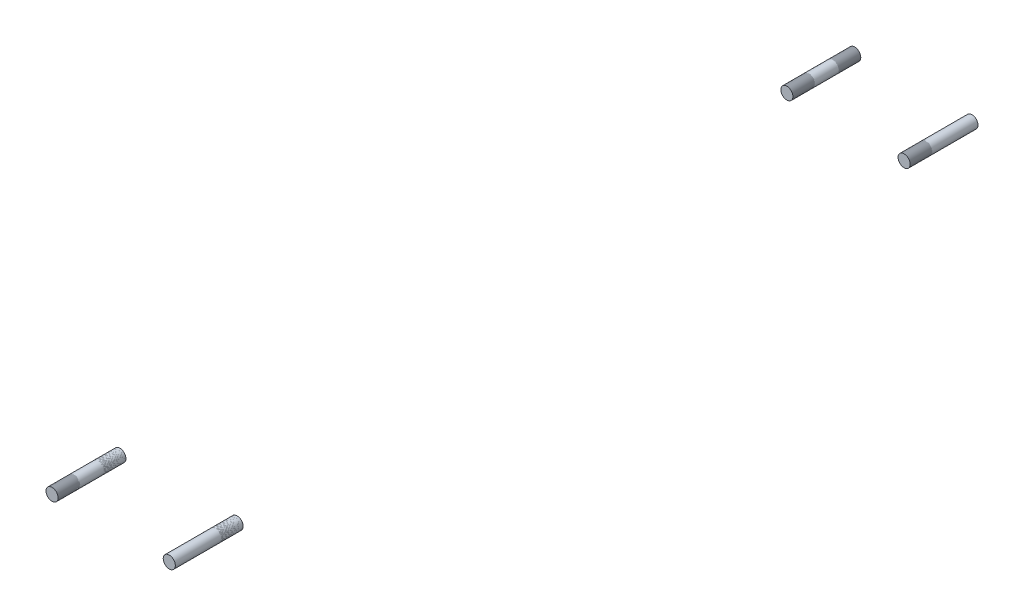
ISO-10303-21;
HEADER;
FILE_DESCRIPTION(('STEP AP214'),'2;1');
FILE_NAME('part.step','',(''),(''),'','','');
FILE_SCHEMA(('AUTOMOTIVE_DESIGN { 1 0 10303 214 1 1 1 1 }'));
ENDSEC;
DATA;
#1=APPLICATION_CONTEXT('core data for automotive mechanical design processes');
#2=APPLICATION_PROTOCOL_DEFINITION('international standard','automotive_design',2000,#1);
#3=PRODUCT_CONTEXT('',#1,'mechanical');
#4=PRODUCT('Part','Part','',(#3));
#5=PRODUCT_RELATED_PRODUCT_CATEGORY('part','',(#4));
#6=PRODUCT_DEFINITION_FORMATION('','',#4);
#7=PRODUCT_DEFINITION_CONTEXT('part definition',#1,'design');
#8=PRODUCT_DEFINITION('design','',#6,#7);
#9=PRODUCT_DEFINITION_SHAPE('','',#8);
#10=(LENGTH_UNIT() NAMED_UNIT(*) SI_UNIT(.MILLI.,.METRE.));
#11=(NAMED_UNIT(*) PLANE_ANGLE_UNIT() SI_UNIT($,.RADIAN.));
#12=(NAMED_UNIT(*) SI_UNIT($,.STERADIAN.) SOLID_ANGLE_UNIT());
#13=UNCERTAINTY_MEASURE_WITH_UNIT(LENGTH_MEASURE(1.E-05),#10,'distance_accuracy_value','');
#14=(GEOMETRIC_REPRESENTATION_CONTEXT(3) GLOBAL_UNCERTAINTY_ASSIGNED_CONTEXT((#13)) GLOBAL_UNIT_ASSIGNED_CONTEXT((#10,
#11,#12)) REPRESENTATION_CONTEXT('',''));
#15=CARTESIAN_POINT('',(0.,0.,0.));
#16=DIRECTION('',(0.,0.,1.));
#17=DIRECTION('',(1.,0.,0.));
#18=AXIS2_PLACEMENT_3D('',#15,#16,#17);
#19=CARTESIAN_POINT('',(0.,0.,48.2981000000001));
#20=DIRECTION('',(0.,0.,1.));
#21=DIRECTION('',(1.,0.,0.));
#22=AXIS2_PLACEMENT_3D('',#19,#20,#21);
#23=PLANE('',#22);
#24=CARTESIAN_POINT('',(86.8680000000001,0.,48.2981000000001));
#25=DIRECTION('',(0.,0.,1.));
#26=DIRECTION('',(1.,0.,0.));
#27=AXIS2_PLACEMENT_3D('',#24,#25,#26);
#28=CIRCLE('',#27,6.35);
#29=CARTESIAN_POINT('',(93.2180000000001,0.,48.2981000000001));
#30=VERTEX_POINT('',#29);
#31=EDGE_CURVE('E11',#30,#30,#28,.F.);
#32=ORIENTED_EDGE('',*,*,#31,.F.);
#33=EDGE_LOOP('',(#32));
#34=FACE_BOUND('',#33,.T.);
#35=ADVANCED_FACE('F43',(#34),#23,.T.);
#36=CARTESIAN_POINT('',(86.868,0.,-22.8600000000001));
#37=DIRECTION('',(0.,0.,-1.));
#38=DIRECTION('',(-1.,0.,0.));
#39=AXIS2_PLACEMENT_3D('',#36,#37,#38);
#40=PLANE('',#39);
#41=CARTESIAN_POINT('',(86.868,0.,-22.8600000000001));
#42=DIRECTION('',(0.,0.,-1.));
#43=DIRECTION('',(-1.,0.,0.));
#44=AXIS2_PLACEMENT_3D('',#41,#42,#43);
#45=CIRCLE('',#44,6.35);
#46=CARTESIAN_POINT('',(80.518,0.,-22.8600000000001));
#47=VERTEX_POINT('',#46);
#48=EDGE_CURVE('E49',#47,#47,#45,.T.);
#49=ORIENTED_EDGE('',*,*,#48,.T.);
#50=EDGE_LOOP('',(#49));
#51=FACE_BOUND('',#50,.T.);
#52=ADVANCED_FACE('F55',(#51),#40,.T.);
#53=CARTESIAN_POINT('',(86.8680000000001,0.,66.2586122421384));
#54=DIRECTION('',(0.,0.,-1.));
#55=DIRECTION('',(-1.,0.,0.));
#56=AXIS2_PLACEMENT_3D('',#53,#54,#55);
#57=CYLINDRICAL_SURFACE('',#56,6.35);
#58=ORIENTED_EDGE('',*,*,#48,.F.);
#59=EDGE_LOOP('',(#58));
#60=FACE_BOUND('',#59,.T.);
#61=ORIENTED_EDGE('',*,*,#31,.T.);
#62=EDGE_LOOP('',(#61));
#63=FACE_BOUND('',#62,.T.);
#64=ADVANCED_FACE('F57',(#60,#63),#57,.T.);
#65=CLOSED_SHELL('',(#35,#52,#64));
#66=MANIFOLD_SOLID_BREP('B2',#65);
#67=CARTESIAN_POINT('',(0.,0.,48.2981000000001));
#68=DIRECTION('',(0.,0.,1.));
#69=DIRECTION('',(1.,0.,0.));
#70=AXIS2_PLACEMENT_3D('',#67,#68,#69);
#71=PLANE('',#70);
#72=CARTESIAN_POINT('',(-36.0679999999999,0.,48.2981000000001));
#73=DIRECTION('',(0.,0.,1.));
#74=DIRECTION('',(1.,0.,0.));
#75=AXIS2_PLACEMENT_3D('',#72,#73,#74);
#76=CIRCLE('',#75,6.35);
#77=CARTESIAN_POINT('',(-29.7179999999999,0.,48.2981000000001));
#78=VERTEX_POINT('',#77);
#79=EDGE_CURVE('E42',#78,#78,#76,.F.);
#80=ORIENTED_EDGE('',*,*,#79,.F.);
#81=EDGE_LOOP('',(#80));
#82=FACE_BOUND('',#81,.T.);
#83=ADVANCED_FACE('F91',(#82),#71,.T.);
#84=CARTESIAN_POINT('',(-36.068,0.,-22.86));
#85=DIRECTION('',(0.,0.,-1.));
#86=DIRECTION('',(-1.,0.,0.));
#87=AXIS2_PLACEMENT_3D('',#84,#85,#86);
#88=PLANE('',#87);
#89=CARTESIAN_POINT('',(-36.068,0.,-22.86));
#90=DIRECTION('',(0.,0.,-1.));
#91=DIRECTION('',(-1.,0.,0.));
#92=AXIS2_PLACEMENT_3D('',#89,#90,#91);
#93=CIRCLE('',#92,6.35);
#94=CARTESIAN_POINT('',(-42.418,0.,-22.86));
#95=VERTEX_POINT('',#94);
#96=EDGE_CURVE('E97',#95,#95,#93,.T.);
#97=ORIENTED_EDGE('',*,*,#96,.T.);
#98=EDGE_LOOP('',(#97));
#99=FACE_BOUND('',#98,.T.);
#100=ADVANCED_FACE('F103',(#99),#88,.T.);
#101=CARTESIAN_POINT('',(-36.0679999999999,0.,66.2586122421384));
#102=DIRECTION('',(0.,0.,-1.));
#103=DIRECTION('',(-1.,0.,0.));
#104=AXIS2_PLACEMENT_3D('',#101,#102,#103);
#105=CYLINDRICAL_SURFACE('',#104,6.35);
#106=ORIENTED_EDGE('',*,*,#96,.F.);
#107=EDGE_LOOP('',(#106));
#108=FACE_BOUND('',#107,.T.);
#109=ORIENTED_EDGE('',*,*,#79,.T.);
#110=EDGE_LOOP('',(#109));
#111=FACE_BOUND('',#110,.T.);
#112=ADVANCED_FACE('F105',(#108,#111),#105,.T.);
#113=CLOSED_SHELL('',(#83,#100,#112));
#114=MANIFOLD_SOLID_BREP('B6',#113);
#115=CARTESIAN_POINT('',(86.868,-20.93468,-811.494612242139));
#116=DIRECTION('',(0.,0.,1.));
#117=DIRECTION('',(1.,0.,0.));
#118=AXIS2_PLACEMENT_3D('',#115,#116,#117);
#119=CYLINDRICAL_SURFACE('',#118,6.35);
#120=CARTESIAN_POINT('',(86.868,-20.93468,-793.5341));
#121=DIRECTION('',(0.,0.,1.));
#122=DIRECTION('',(1.,0.,0.));
#123=AXIS2_PLACEMENT_3D('',#120,#121,#122);
#124=CIRCLE('',#123,6.35);
#125=CARTESIAN_POINT('',(93.218,-20.93468,-793.5341));
#126=VERTEX_POINT('',#125);
#127=EDGE_CURVE('E90',#126,#126,#124,.F.);
#128=ORIENTED_EDGE('',*,*,#127,.F.);
#129=EDGE_LOOP('',(#128));
#130=FACE_BOUND('',#129,.T.);
#131=CARTESIAN_POINT('',(86.868,-20.93468,-722.376));
#132=DIRECTION('',(0.,0.,1.));
#133=DIRECTION('',(1.,0.,0.));
#134=AXIS2_PLACEMENT_3D('',#131,#132,#133);
#135=CIRCLE('',#134,6.35);
#136=CARTESIAN_POINT('',(93.218,-20.93468,-722.376));
#137=VERTEX_POINT('',#136);
#138=EDGE_CURVE('E145',#137,#137,#135,.T.);
#139=ORIENTED_EDGE('',*,*,#138,.F.);
#140=EDGE_LOOP('',(#139));
#141=FACE_BOUND('',#140,.T.);
#142=ADVANCED_FACE('F139',(#130,#141),#119,.T.);
#143=CARTESIAN_POINT('',(86.868,-20.93468,-722.376));
#144=DIRECTION('',(0.,0.,1.));
#145=DIRECTION('',(1.,0.,0.));
#146=AXIS2_PLACEMENT_3D('',#143,#144,#145);
#147=PLANE('',#146);
#148=ORIENTED_EDGE('',*,*,#138,.T.);
#149=EDGE_LOOP('',(#148));
#150=FACE_BOUND('',#149,.T.);
#151=ADVANCED_FACE('F151',(#150),#147,.T.);
#152=CARTESIAN_POINT('',(0.,0.,-793.5341));
#153=DIRECTION('',(0.,0.,1.));
#154=DIRECTION('',(1.,0.,0.));
#155=AXIS2_PLACEMENT_3D('',#152,#153,#154);
#156=PLANE('',#155);
#157=ORIENTED_EDGE('',*,*,#127,.T.);
#158=EDGE_LOOP('',(#157));
#159=FACE_BOUND('',#158,.T.);
#160=ADVANCED_FACE('F158',(#159),#156,.F.);
#161=CLOSED_SHELL('',(#142,#151,#160));
#162=MANIFOLD_SOLID_BREP('B37',#161);
#163=CARTESIAN_POINT('',(-36.0680000000002,-20.93468,-811.494612242139));
#164=DIRECTION('',(0.,0.,1.));
#165=DIRECTION('',(1.,0.,0.));
#166=AXIS2_PLACEMENT_3D('',#163,#164,#165);
#167=CYLINDRICAL_SURFACE('',#166,6.35);
#168=CARTESIAN_POINT('',(-36.0680000000002,-20.93468,-793.5341));
#169=DIRECTION('',(0.,0.,1.));
#170=DIRECTION('',(1.,0.,0.));
#171=AXIS2_PLACEMENT_3D('',#168,#169,#170);
#172=CIRCLE('',#171,6.35);
#173=CARTESIAN_POINT('',(-29.7180000000002,-20.93468,-793.5341));
#174=VERTEX_POINT('',#173);
#175=EDGE_CURVE('E138',#174,#174,#172,.F.);
#176=ORIENTED_EDGE('',*,*,#175,.F.);
#177=EDGE_LOOP('',(#176));
#178=FACE_BOUND('',#177,.T.);
#179=CARTESIAN_POINT('',(-36.0680000000002,-20.93468,-722.376));
#180=DIRECTION('',(0.,0.,1.));
#181=DIRECTION('',(1.,0.,0.));
#182=AXIS2_PLACEMENT_3D('',#179,#180,#181);
#183=CIRCLE('',#182,6.35);
#184=CARTESIAN_POINT('',(-29.7180000000002,-20.93468,-722.376));
#185=VERTEX_POINT('',#184);
#186=EDGE_CURVE('E193',#185,#185,#183,.T.);
#187=ORIENTED_EDGE('',*,*,#186,.F.);
#188=EDGE_LOOP('',(#187));
#189=FACE_BOUND('',#188,.T.);
#190=ADVANCED_FACE('F187',(#178,#189),#167,.T.);
#191=CARTESIAN_POINT('',(-36.0680000000002,-20.93468,-722.376));
#192=DIRECTION('',(0.,0.,1.));
#193=DIRECTION('',(1.,0.,0.));
#194=AXIS2_PLACEMENT_3D('',#191,#192,#193);
#195=PLANE('',#194);
#196=ORIENTED_EDGE('',*,*,#186,.T.);
#197=EDGE_LOOP('',(#196));
#198=FACE_BOUND('',#197,.T.);
#199=ADVANCED_FACE('F199',(#198),#195,.T.);
#200=CARTESIAN_POINT('',(0.,0.,-793.5341));
#201=DIRECTION('',(0.,0.,1.));
#202=DIRECTION('',(1.,0.,0.));
#203=AXIS2_PLACEMENT_3D('',#200,#201,#202);
#204=PLANE('',#203);
#205=ORIENTED_EDGE('',*,*,#175,.T.);
#206=EDGE_LOOP('',(#205));
#207=FACE_BOUND('',#206,.T.);
#208=ADVANCED_FACE('F206',(#207),#204,.F.);
#209=CLOSED_SHELL('',(#190,#199,#208));
#210=MANIFOLD_SOLID_BREP('B85',#209);
#211=CARTESIAN_POINT('',(-36.0680000000002,-20.9346799999999,-782.1041));
#212=DIRECTION('',(0.,0.,-1.));
#213=DIRECTION('',(0.892294712628054,-0.451453370588833,0.));
#214=AXIS2_PLACEMENT_3D('',#211,#212,#213);
#215=CYLINDRICAL_SURFACE('',#214,6.35);
#216=CARTESIAN_POINT('',(-36.0680000000002,-20.9346799999999,-793.5341));
#217=DIRECTION('',(0.,0.,-1.));
#218=DIRECTION('',(0.892294712628054,-0.451453370588833,0.));
#219=AXIS2_PLACEMENT_3D('',#216,#217,#218);
#220=CIRCLE('',#219,6.35);
#221=CARTESIAN_POINT('',(-30.4019285748121,-23.801408903239,-793.5341));
#222=VERTEX_POINT('',#221);
#223=EDGE_CURVE('E239',#222,#222,#220,.F.);
#224=ORIENTED_EDGE('',*,*,#223,.F.);
#225=EDGE_LOOP('',(#224));
#226=FACE_BOUND('',#225,.T.);
#227=CARTESIAN_POINT('',(-36.0680000000002,-20.9346799999999,-770.6741));
#228=DIRECTION('',(0.,0.,-1.));
#229=DIRECTION('',(0.892294712628054,-0.451453370588833,0.));
#230=AXIS2_PLACEMENT_3D('',#227,#228,#229);
#231=CIRCLE('',#230,6.35);
#232=CARTESIAN_POINT('',(-30.4019285748121,-23.801408903239,-770.6741));
#233=VERTEX_POINT('',#232);
#234=EDGE_CURVE('E186',#233,#233,#231,.T.);
#235=ORIENTED_EDGE('',*,*,#234,.F.);
#236=EDGE_LOOP('',(#235));
#237=FACE_BOUND('',#236,.T.);
#238=ADVANCED_FACE('F235',(#226,#237),#215,.F.);
#239=OPEN_SHELL('',(#238));
#240=SHELL_BASED_SURFACE_MODEL('B133',(#239));
#241=CARTESIAN_POINT('',(86.868,-20.93468,-733.806));
#242=DIRECTION('',(0.,0.,1.));
#243=DIRECTION('',(-1.,0.,0.));
#244=AXIS2_PLACEMENT_3D('',#241,#242,#243);
#245=CYLINDRICAL_SURFACE('',#244,6.35);
#246=CARTESIAN_POINT('',(86.868,-20.93468,-745.236));
#247=DIRECTION('',(0.,0.,1.));
#248=DIRECTION('',(-1.,0.,0.));
#249=AXIS2_PLACEMENT_3D('',#246,#247,#248);
#250=CIRCLE('',#249,6.35);
#251=CARTESIAN_POINT('',(80.518,-20.93468,-745.236));
#252=VERTEX_POINT('',#251);
#253=EDGE_CURVE('E273',#252,#252,#250,.T.);
#254=ORIENTED_EDGE('',*,*,#253,.F.);
#255=EDGE_LOOP('',(#254));
#256=FACE_BOUND('',#255,.T.);
#257=CARTESIAN_POINT('',(86.868,-20.93468,-722.376));
#258=DIRECTION('',(0.,0.,1.));
#259=DIRECTION('',(-1.,0.,0.));
#260=AXIS2_PLACEMENT_3D('',#257,#258,#259);
#261=CIRCLE('',#260,6.35);
#262=CARTESIAN_POINT('',(80.518,-20.93468,-722.376));
#263=VERTEX_POINT('',#262);
#264=EDGE_CURVE('E234',#263,#263,#261,.F.);
#265=ORIENTED_EDGE('',*,*,#264,.F.);
#266=EDGE_LOOP('',(#265));
#267=FACE_BOUND('',#266,.T.);
#268=ADVANCED_FACE('F269',(#256,#267),#245,.F.);
#269=OPEN_SHELL('',(#268));
#270=SHELL_BASED_SURFACE_MODEL('B181',(#269));
#271=CARTESIAN_POINT('',(-36.0680000000002,-20.93468,-733.806));
#272=DIRECTION('',(0.,0.,1.));
#273=DIRECTION('',(-1.,0.,0.));
#274=AXIS2_PLACEMENT_3D('',#271,#272,#273);
#275=CYLINDRICAL_SURFACE('',#274,6.35);
#276=CARTESIAN_POINT('',(-36.0680000000002,-20.93468,-745.236));
#277=DIRECTION('',(0.,0.,1.));
#278=DIRECTION('',(-1.,0.,0.));
#279=AXIS2_PLACEMENT_3D('',#276,#277,#278);
#280=CIRCLE('',#279,6.35);
#281=CARTESIAN_POINT('',(-42.4180000000002,-20.93468,-745.236));
#282=VERTEX_POINT('',#281);
#283=EDGE_CURVE('E305',#282,#282,#280,.T.);
#284=ORIENTED_EDGE('',*,*,#283,.F.);
#285=EDGE_LOOP('',(#284));
#286=FACE_BOUND('',#285,.T.);
#287=CARTESIAN_POINT('',(-36.0680000000002,-20.93468,-722.376));
#288=DIRECTION('',(0.,0.,1.));
#289=DIRECTION('',(-1.,0.,0.));
#290=AXIS2_PLACEMENT_3D('',#287,#288,#289);
#291=CIRCLE('',#290,6.35);
#292=CARTESIAN_POINT('',(-42.4180000000002,-20.93468,-722.376));
#293=VERTEX_POINT('',#292);
#294=EDGE_CURVE('E268',#293,#293,#291,.F.);
#295=ORIENTED_EDGE('',*,*,#294,.F.);
#296=EDGE_LOOP('',(#295));
#297=FACE_BOUND('',#296,.T.);
#298=ADVANCED_FACE('F301',(#286,#297),#275,.F.);
#299=OPEN_SHELL('',(#298));
#300=SHELL_BASED_SURFACE_MODEL('B229',(#299));
#301=CARTESIAN_POINT('',(-36.068,0.,-11.43));
#302=DIRECTION('',(0.,0.,-1.));
#303=DIRECTION('',(-1.,0.,0.));
#304=AXIS2_PLACEMENT_3D('',#301,#302,#303);
#305=CYLINDRICAL_SURFACE('',#304,6.35);
#306=CARTESIAN_POINT('',(-36.068,0.,0.));
#307=DIRECTION('',(0.,0.,-1.));
#308=DIRECTION('',(-1.,0.,0.));
#309=AXIS2_PLACEMENT_3D('',#306,#307,#308);
#310=CIRCLE('',#309,6.35);
#311=CARTESIAN_POINT('',(-42.418,0.,0.));
#312=VERTEX_POINT('',#311);
#313=EDGE_CURVE('E337',#312,#312,#310,.T.);
#314=ORIENTED_EDGE('',*,*,#313,.F.);
#315=EDGE_LOOP('',(#314));
#316=FACE_BOUND('',#315,.T.);
#317=CARTESIAN_POINT('',(-36.068,0.,-22.86));
#318=DIRECTION('',(0.,0.,-1.));
#319=DIRECTION('',(-1.,0.,0.));
#320=AXIS2_PLACEMENT_3D('',#317,#318,#319);
#321=CIRCLE('',#320,6.35);
#322=CARTESIAN_POINT('',(-42.418,0.,-22.86));
#323=VERTEX_POINT('',#322);
#324=EDGE_CURVE('E300',#323,#323,#321,.F.);
#325=ORIENTED_EDGE('',*,*,#324,.F.);
#326=EDGE_LOOP('',(#325));
#327=FACE_BOUND('',#326,.T.);
#328=ADVANCED_FACE('F333',(#316,#327),#305,.F.);
#329=OPEN_SHELL('',(#328));
#330=SHELL_BASED_SURFACE_MODEL('B263',(#329));
#331=CARTESIAN_POINT('',(-36.068,0.,36.8681000000001));
#332=DIRECTION('',(0.,0.,1.));
#333=DIRECTION('',(0.757966435656567,-0.652293555401308,0.));
#334=AXIS2_PLACEMENT_3D('',#331,#332,#333);
#335=CYLINDRICAL_SURFACE('',#334,6.35);
#336=CARTESIAN_POINT('',(-36.068,0.,48.2981000000001));
#337=DIRECTION('',(0.,0.,1.));
#338=DIRECTION('',(0.757966435656567,-0.652293555401308,0.));
#339=AXIS2_PLACEMENT_3D('',#336,#337,#338);
#340=CIRCLE('',#339,6.35);
#341=CARTESIAN_POINT('',(-31.2549131335808,-4.1420640767983,48.2981000000001));
#342=VERTEX_POINT('',#341);
#343=EDGE_CURVE('E368',#342,#342,#340,.F.);
#344=ORIENTED_EDGE('',*,*,#343,.F.);
#345=EDGE_LOOP('',(#344));
#346=FACE_BOUND('',#345,.T.);
#347=CARTESIAN_POINT('',(-36.068,0.,25.4381000000001));
#348=DIRECTION('',(0.,0.,1.));
#349=DIRECTION('',(0.757966435656567,-0.652293555401308,0.));
#350=AXIS2_PLACEMENT_3D('',#347,#348,#349);
#351=CIRCLE('',#350,6.35);
#352=CARTESIAN_POINT('',(-31.2549131335808,-4.14206407679831,25.4381000000001));
#353=VERTEX_POINT('',#352);
#354=EDGE_CURVE('E332',#353,#353,#351,.T.);
#355=ORIENTED_EDGE('',*,*,#354,.F.);
#356=EDGE_LOOP('',(#355));
#357=FACE_BOUND('',#356,.T.);
#358=ADVANCED_FACE('F364',(#346,#357),#335,.F.);
#359=OPEN_SHELL('',(#358));
#360=SHELL_BASED_SURFACE_MODEL('B295',(#359));
#361=CARTESIAN_POINT('',(86.868,0.,-11.4300000000001));
#362=DIRECTION('',(0.,0.,-1.));
#363=DIRECTION('',(-1.,0.,0.));
#364=AXIS2_PLACEMENT_3D('',#361,#362,#363);
#365=CYLINDRICAL_SURFACE('',#364,6.35);
#366=CARTESIAN_POINT('',(86.868,0.,0.));
#367=DIRECTION('',(0.,0.,-1.));
#368=DIRECTION('',(-1.,0.,0.));
#369=AXIS2_PLACEMENT_3D('',#366,#367,#368);
#370=CIRCLE('',#369,6.35);
#371=CARTESIAN_POINT('',(80.518,0.,0.));
#372=VERTEX_POINT('',#371);
#373=EDGE_CURVE('E394',#372,#372,#370,.T.);
#374=ORIENTED_EDGE('',*,*,#373,.F.);
#375=EDGE_LOOP('',(#374));
#376=FACE_BOUND('',#375,.T.);
#377=CARTESIAN_POINT('',(86.868,0.,-22.8600000000001));
#378=DIRECTION('',(0.,0.,-1.));
#379=DIRECTION('',(-1.,0.,0.));
#380=AXIS2_PLACEMENT_3D('',#377,#378,#379);
#381=CIRCLE('',#380,6.35);
#382=CARTESIAN_POINT('',(80.518,0.,-22.8600000000001));
#383=VERTEX_POINT('',#382);
#384=EDGE_CURVE('E363',#383,#383,#381,.F.);
#385=ORIENTED_EDGE('',*,*,#384,.F.);
#386=EDGE_LOOP('',(#385));
#387=FACE_BOUND('',#386,.T.);
#388=ADVANCED_FACE('F390',(#376,#387),#365,.F.);
#389=OPEN_SHELL('',(#388));
#390=SHELL_BASED_SURFACE_MODEL('B327',(#389));
#391=ADVANCED_BREP_SHAPE_REPRESENTATION('',(#18,#66,#114,#162,#210),#14);
#392=MANIFOLD_SURFACE_SHAPE_REPRESENTATION('',(#18,#240,#270,#300,#330,#360,#390),#14);
#393=SHAPE_REPRESENTATION('',(#18),#14);
#394=SHAPE_DEFINITION_REPRESENTATION(#9,#393);
#395=SHAPE_REPRESENTATION_RELATIONSHIP('','',#393,#391);
#396=SHAPE_REPRESENTATION_RELATIONSHIP('','',#393,#392);
ENDSEC;
END-ISO-10303-21;
